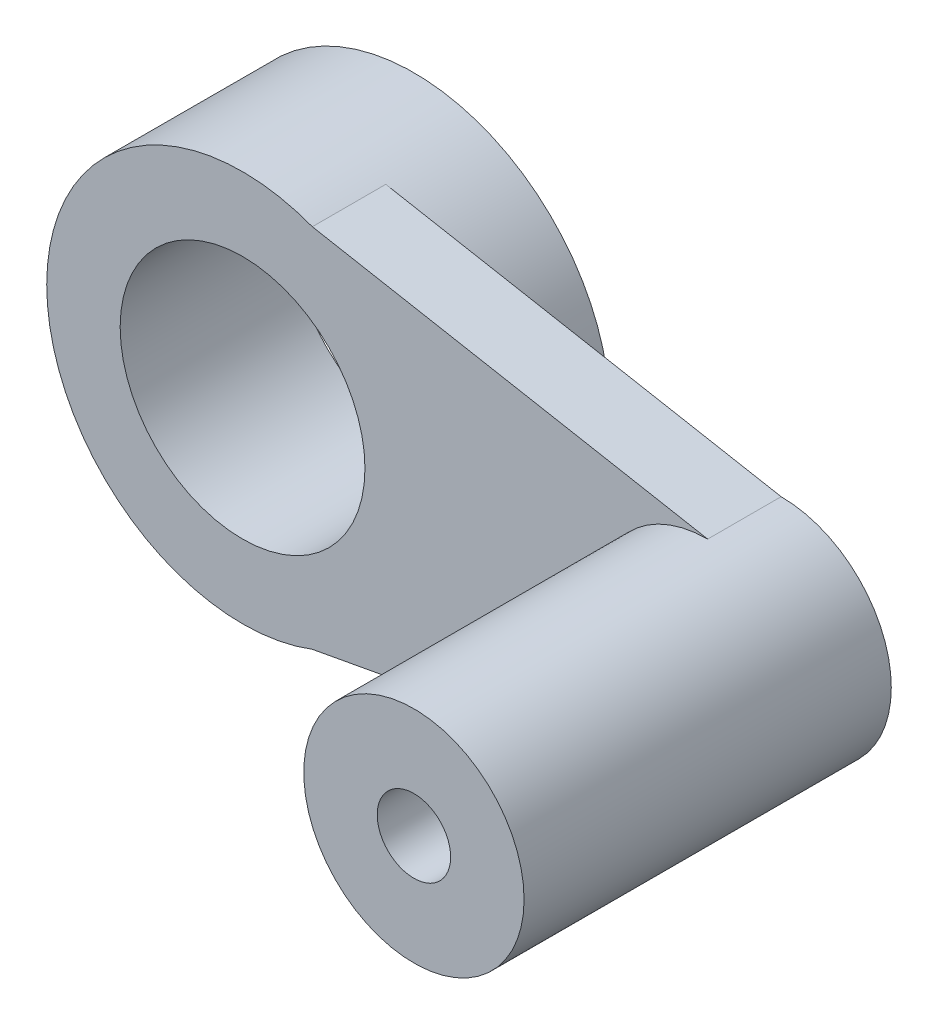
ISO-10303-21;
HEADER;
FILE_DESCRIPTION(('STEP AP214'),'2;1');
FILE_NAME('part.step','',(''),(''),'','','');
FILE_SCHEMA(('AUTOMOTIVE_DESIGN { 1 0 10303 214 1 1 1 1 }'));
ENDSEC;
DATA;
#1=APPLICATION_CONTEXT('core data for automotive mechanical design processes');
#2=APPLICATION_PROTOCOL_DEFINITION('international standard','automotive_design',2000,#1);
#3=PRODUCT_CONTEXT('',#1,'mechanical');
#4=PRODUCT('Part','Part','',(#3));
#5=PRODUCT_RELATED_PRODUCT_CATEGORY('part','',(#4));
#6=PRODUCT_DEFINITION_FORMATION('','',#4);
#7=PRODUCT_DEFINITION_CONTEXT('part definition',#1,'design');
#8=PRODUCT_DEFINITION('design','',#6,#7);
#9=PRODUCT_DEFINITION_SHAPE('','',#8);
#10=(LENGTH_UNIT() NAMED_UNIT(*) SI_UNIT(.MILLI.,.METRE.));
#11=(NAMED_UNIT(*) PLANE_ANGLE_UNIT() SI_UNIT($,.RADIAN.));
#12=(NAMED_UNIT(*) SI_UNIT($,.STERADIAN.) SOLID_ANGLE_UNIT());
#13=UNCERTAINTY_MEASURE_WITH_UNIT(LENGTH_MEASURE(1.E-05),#10,'distance_accuracy_value','');
#14=(GEOMETRIC_REPRESENTATION_CONTEXT(3) GLOBAL_UNCERTAINTY_ASSIGNED_CONTEXT((#13)) GLOBAL_UNIT_ASSIGNED_CONTEXT((#10,
#11,#12)) REPRESENTATION_CONTEXT('',''));
#15=CARTESIAN_POINT('',(0.,0.,0.));
#16=DIRECTION('',(0.,0.,1.));
#17=DIRECTION('',(1.,0.,0.));
#18=AXIS2_PLACEMENT_3D('',#15,#16,#17);
#19=CARTESIAN_POINT('',(0.,0.,14.));
#20=DIRECTION('',(0.,0.,1.));
#21=DIRECTION('',(1.,0.,0.));
#22=AXIS2_PLACEMENT_3D('',#19,#20,#21);
#23=PLANE('',#22);
#24=CARTESIAN_POINT('',(38.,0.,14.));
#25=DIRECTION('',(0.,0.,1.));
#26=DIRECTION('',(1.,0.,0.));
#27=AXIS2_PLACEMENT_3D('',#24,#25,#26);
#28=CIRCLE('',#27,9.);
#29=CARTESIAN_POINT('',(38.,9.,14.));
#30=VERTEX_POINT('',#29);
#31=CARTESIAN_POINT('',(38.,-9.,14.));
#32=VERTEX_POINT('',#31);
#33=EDGE_CURVE('E86',#30,#32,#28,.T.);
#34=ORIENTED_EDGE('',*,*,#33,.F.);
#35=DIRECTION('',(0.983453188589073,-0.181162429476934,0.));
#36=VECTOR('',#35,1.);
#37=CARTESIAN_POINT('',(2.85063630274615,15.4748827863362,14.));
#38=LINE('',#37,#36);
#39=CARTESIAN_POINT('',(5.70127260549231,14.9497655726725,14.));
#40=VERTEX_POINT('',#39);
#41=EDGE_CURVE('E57',#40,#30,#38,.T.);
#42=ORIENTED_EDGE('',*,*,#41,.F.);
#43=CARTESIAN_POINT('',(0.,0.,14.));
#44=DIRECTION('',(0.,0.,1.));
#45=DIRECTION('',(1.,0.,0.));
#46=AXIS2_PLACEMENT_3D('',#43,#44,#45);
#47=CIRCLE('',#46,16.);
#48=CARTESIAN_POINT('',(5.70127260549231,-14.9497655726725,14.));
#49=VERTEX_POINT('',#48);
#50=EDGE_CURVE('E11',#40,#49,#47,.T.);
#51=ORIENTED_EDGE('',*,*,#50,.T.);
#52=DIRECTION('',(0.983453188589073,0.181162429476934,0.));
#53=VECTOR('',#52,1.);
#54=CARTESIAN_POINT('',(2.85063630274615,-15.4748827863362,14.));
#55=LINE('',#54,#53);
#56=EDGE_CURVE('E78',#49,#32,#55,.T.);
#57=ORIENTED_EDGE('',*,*,#56,.T.);
#58=EDGE_LOOP('',(#34,#42,#51,#57));
#59=FACE_BOUND('',#58,.T.);
#60=CARTESIAN_POINT('',(0.,0.,14.));
#61=DIRECTION('',(0.,0.,1.));
#62=DIRECTION('',(1.,0.,0.));
#63=AXIS2_PLACEMENT_3D('',#60,#61,#62);
#64=CIRCLE('',#63,10.);
#65=CARTESIAN_POINT('',(10.,0.,14.));
#66=VERTEX_POINT('',#65);
#67=EDGE_CURVE('E120',#66,#66,#64,.T.);
#68=ORIENTED_EDGE('',*,*,#67,.F.);
#69=EDGE_LOOP('',(#68));
#70=FACE_BOUND('',#69,.T.);
#71=ADVANCED_FACE('F43',(#59,#70),#23,.T.);
#72=CARTESIAN_POINT('',(0.,0.,0.));
#73=DIRECTION('',(0.,0.,1.));
#74=DIRECTION('',(1.,0.,0.));
#75=AXIS2_PLACEMENT_3D('',#72,#73,#74);
#76=PLANE('',#75);
#77=CARTESIAN_POINT('',(0.,0.,0.));
#78=DIRECTION('',(0.,0.,1.));
#79=DIRECTION('',(1.,0.,0.));
#80=AXIS2_PLACEMENT_3D('',#77,#78,#79);
#81=CIRCLE('',#80,16.);
#82=CARTESIAN_POINT('',(16.,0.,0.));
#83=VERTEX_POINT('',#82);
#84=EDGE_CURVE('E47',#83,#83,#81,.T.);
#85=ORIENTED_EDGE('',*,*,#84,.F.);
#86=EDGE_LOOP('',(#85));
#87=FACE_BOUND('',#86,.T.);
#88=CARTESIAN_POINT('',(0.,0.,0.));
#89=DIRECTION('',(0.,0.,1.));
#90=DIRECTION('',(1.,0.,0.));
#91=AXIS2_PLACEMENT_3D('',#88,#89,#90);
#92=CIRCLE('',#91,10.);
#93=CARTESIAN_POINT('',(10.,0.,0.));
#94=VERTEX_POINT('',#93);
#95=EDGE_CURVE('E116',#94,#94,#92,.T.);
#96=ORIENTED_EDGE('',*,*,#95,.T.);
#97=EDGE_LOOP('',(#96));
#98=FACE_BOUND('',#97,.T.);
#99=ADVANCED_FACE('F126',(#87,#98),#76,.F.);
#100=CARTESIAN_POINT('',(0.,0.,14.));
#101=DIRECTION('',(0.,0.,-1.));
#102=DIRECTION('',(-1.,0.,0.));
#103=AXIS2_PLACEMENT_3D('',#100,#101,#102);
#104=CYLINDRICAL_SURFACE('',#103,16.);
#105=CARTESIAN_POINT('',(0.,0.,8.));
#106=DIRECTION('',(0.,0.,1.));
#107=DIRECTION('',(1.,0.,0.));
#108=AXIS2_PLACEMENT_3D('',#105,#106,#107);
#109=CIRCLE('',#108,16.);
#110=CARTESIAN_POINT('',(5.70127260549231,-14.9497655726725,8.));
#111=VERTEX_POINT('',#110);
#112=CARTESIAN_POINT('',(5.70127260549231,14.9497655726725,8.));
#113=VERTEX_POINT('',#112);
#114=EDGE_CURVE('E265',#111,#113,#109,.T.);
#115=ORIENTED_EDGE('',*,*,#114,.F.);
#116=DIRECTION('',(0.,0.,1.));
#117=VECTOR('',#116,1.);
#118=CARTESIAN_POINT('',(5.70127260549231,-14.9497655726725,8.));
#119=LINE('',#118,#117);
#120=EDGE_CURVE('E117',#111,#49,#119,.T.);
#121=ORIENTED_EDGE('',*,*,#120,.T.);
#122=ORIENTED_EDGE('',*,*,#50,.F.);
#123=DIRECTION('',(0.,0.,1.));
#124=VECTOR('',#123,1.);
#125=CARTESIAN_POINT('',(5.70127260549231,14.9497655726725,8.));
#126=LINE('',#125,#124);
#127=EDGE_CURVE('E100',#113,#40,#126,.T.);
#128=ORIENTED_EDGE('',*,*,#127,.F.);
#129=EDGE_LOOP('',(#115,#121,#122,#128));
#130=FACE_BOUND('',#129,.T.);
#131=ORIENTED_EDGE('',*,*,#84,.T.);
#132=EDGE_LOOP('',(#131));
#133=FACE_BOUND('',#132,.T.);
#134=ADVANCED_FACE('F45',(#130,#133),#104,.T.);
#135=CARTESIAN_POINT('',(0.,0.,14.));
#136=DIRECTION('',(0.,0.,-1.));
#137=DIRECTION('',(-1.,0.,0.));
#138=AXIS2_PLACEMENT_3D('',#135,#136,#137);
#139=CYLINDRICAL_SURFACE('',#138,10.);
#140=ORIENTED_EDGE('',*,*,#67,.T.);
#141=EDGE_LOOP('',(#140));
#142=FACE_BOUND('',#141,.T.);
#143=ORIENTED_EDGE('',*,*,#95,.F.);
#144=EDGE_LOOP('',(#143));
#145=FACE_BOUND('',#144,.T.);
#146=ADVANCED_FACE('F128',(#142,#145),#139,.F.);
#147=CARTESIAN_POINT('',(2.85063630274615,-15.4748827863362,8.));
#148=DIRECTION('',(0.181162429476934,-0.983453188589073,0.));
#149=DIRECTION('',(0.983453188589073,0.181162429476934,0.));
#150=AXIS2_PLACEMENT_3D('',#147,#148,#149);
#151=PLANE('',#150);
#152=ORIENTED_EDGE('',*,*,#56,.F.);
#153=ORIENTED_EDGE('',*,*,#120,.F.);
#154=DIRECTION('',(0.983453188589073,0.181162429476934,0.));
#155=VECTOR('',#154,1.);
#156=CARTESIAN_POINT('',(2.85063630274615,-15.4748827863362,8.));
#157=LINE('',#156,#155);
#158=CARTESIAN_POINT('',(38.,-9.,8.));
#159=VERTEX_POINT('',#158);
#160=EDGE_CURVE('E101',#111,#159,#157,.T.);
#161=ORIENTED_EDGE('',*,*,#160,.T.);
#162=DIRECTION('',(0.,0.,1.));
#163=VECTOR('',#162,1.);
#164=CARTESIAN_POINT('',(38.,-9.,8.));
#165=LINE('',#164,#163);
#166=EDGE_CURVE('E114',#159,#32,#165,.T.);
#167=ORIENTED_EDGE('',*,*,#166,.T.);
#168=EDGE_LOOP('',(#152,#153,#161,#167));
#169=FACE_BOUND('',#168,.T.);
#170=ADVANCED_FACE('F130',(#169),#151,.T.);
#171=CARTESIAN_POINT('',(2.85063630274615,15.4748827863362,8.));
#172=DIRECTION('',(-0.181162429476934,-0.983453188589073,0.));
#173=DIRECTION('',(0.983453188589073,-0.181162429476934,0.));
#174=AXIS2_PLACEMENT_3D('',#171,#172,#173);
#175=PLANE('',#174);
#176=ORIENTED_EDGE('',*,*,#41,.T.);
#177=DIRECTION('',(0.,0.,1.));
#178=VECTOR('',#177,1.);
#179=CARTESIAN_POINT('',(38.,9.,8.));
#180=LINE('',#179,#178);
#181=CARTESIAN_POINT('',(38.,9.,8.));
#182=VERTEX_POINT('',#181);
#183=EDGE_CURVE('E95',#182,#30,#180,.T.);
#184=ORIENTED_EDGE('',*,*,#183,.F.);
#185=DIRECTION('',(0.983453188589073,-0.181162429476934,0.));
#186=VECTOR('',#185,1.);
#187=CARTESIAN_POINT('',(2.85063630274615,15.4748827863362,8.));
#188=LINE('',#187,#186);
#189=EDGE_CURVE('E107',#113,#182,#188,.T.);
#190=ORIENTED_EDGE('',*,*,#189,.F.);
#191=ORIENTED_EDGE('',*,*,#127,.T.);
#192=EDGE_LOOP('',(#176,#184,#190,#191));
#193=FACE_BOUND('',#192,.T.);
#194=ADVANCED_FACE('F103',(#193),#175,.F.);
#195=CARTESIAN_POINT('',(0.,0.,8.));
#196=DIRECTION('',(0.,0.,1.));
#197=DIRECTION('',(1.,0.,0.));
#198=AXIS2_PLACEMENT_3D('',#195,#196,#197);
#199=PLANE('',#198);
#200=ORIENTED_EDGE('',*,*,#189,.T.);
#201=CARTESIAN_POINT('',(38.,0.,8.));
#202=DIRECTION('',(0.,0.,-1.));
#203=DIRECTION('',(-1.,0.,0.));
#204=AXIS2_PLACEMENT_3D('',#201,#202,#203);
#205=CIRCLE('',#204,9.);
#206=EDGE_CURVE('E66',#182,#159,#205,.T.);
#207=ORIENTED_EDGE('',*,*,#206,.T.);
#208=ORIENTED_EDGE('',*,*,#160,.F.);
#209=ORIENTED_EDGE('',*,*,#114,.T.);
#210=EDGE_LOOP('',(#200,#207,#208,#209));
#211=FACE_BOUND('',#210,.T.);
#212=CARTESIAN_POINT('',(38.,0.,8.));
#213=DIRECTION('',(0.,0.,-1.));
#214=DIRECTION('',(-1.,0.,0.));
#215=AXIS2_PLACEMENT_3D('',#212,#213,#214);
#216=CIRCLE('',#215,3.);
#217=CARTESIAN_POINT('',(35.,0.,8.));
#218=VERTEX_POINT('',#217);
#219=EDGE_CURVE('E109',#218,#218,#216,.T.);
#220=ORIENTED_EDGE('',*,*,#219,.F.);
#221=EDGE_LOOP('',(#220));
#222=FACE_BOUND('',#221,.T.);
#223=ADVANCED_FACE('F181',(#211,#222),#199,.F.);
#224=CARTESIAN_POINT('',(38.,0.,8.));
#225=DIRECTION('',(0.,0.,1.));
#226=DIRECTION('',(1.,0.,0.));
#227=AXIS2_PLACEMENT_3D('',#224,#225,#226);
#228=CYLINDRICAL_SURFACE('',#227,9.);
#229=ORIENTED_EDGE('',*,*,#166,.F.);
#230=ORIENTED_EDGE('',*,*,#206,.F.);
#231=ORIENTED_EDGE('',*,*,#183,.T.);
#232=ORIENTED_EDGE('',*,*,#33,.T.);
#233=EDGE_LOOP('',(#229,#230,#231,#232));
#234=FACE_BOUND('',#233,.T.);
#235=CARTESIAN_POINT('',(38.,0.,38.));
#236=DIRECTION('',(0.,0.,1.));
#237=DIRECTION('',(1.,0.,0.));
#238=AXIS2_PLACEMENT_3D('',#235,#236,#237);
#239=CIRCLE('',#238,9.);
#240=CARTESIAN_POINT('',(47.,0.,38.));
#241=VERTEX_POINT('',#240);
#242=EDGE_CURVE('E91',#241,#241,#239,.T.);
#243=ORIENTED_EDGE('',*,*,#242,.F.);
#244=EDGE_LOOP('',(#243));
#245=FACE_BOUND('',#244,.T.);
#246=ADVANCED_FACE('F96',(#234,#245),#228,.T.);
#247=CARTESIAN_POINT('',(38.,0.,8.));
#248=DIRECTION('',(0.,0.,1.));
#249=DIRECTION('',(1.,0.,0.));
#250=AXIS2_PLACEMENT_3D('',#247,#248,#249);
#251=CYLINDRICAL_SURFACE('',#250,3.);
#252=ORIENTED_EDGE('',*,*,#219,.T.);
#253=EDGE_LOOP('',(#252));
#254=FACE_BOUND('',#253,.T.);
#255=CARTESIAN_POINT('',(38.,0.,38.));
#256=DIRECTION('',(0.,0.,1.));
#257=DIRECTION('',(1.,0.,0.));
#258=AXIS2_PLACEMENT_3D('',#255,#256,#257);
#259=CIRCLE('',#258,3.);
#260=CARTESIAN_POINT('',(41.,0.,38.));
#261=VERTEX_POINT('',#260);
#262=EDGE_CURVE('E92',#261,#261,#259,.T.);
#263=ORIENTED_EDGE('',*,*,#262,.T.);
#264=EDGE_LOOP('',(#263));
#265=FACE_BOUND('',#264,.T.);
#266=ADVANCED_FACE('F198',(#254,#265),#251,.F.);
#267=CARTESIAN_POINT('',(38.,0.,38.));
#268=DIRECTION('',(0.,0.,1.));
#269=DIRECTION('',(1.,0.,0.));
#270=AXIS2_PLACEMENT_3D('',#267,#268,#269);
#271=PLANE('',#270);
#272=ORIENTED_EDGE('',*,*,#242,.T.);
#273=EDGE_LOOP('',(#272));
#274=FACE_BOUND('',#273,.T.);
#275=ORIENTED_EDGE('',*,*,#262,.F.);
#276=EDGE_LOOP('',(#275));
#277=FACE_BOUND('',#276,.T.);
#278=ADVANCED_FACE('F208',(#274,#277),#271,.T.);
#279=CLOSED_SHELL('',(#71,#99,#134,#146,#170,#194,#223,#246,#266,#278));
#280=MANIFOLD_SOLID_BREP('B2',#279);
#281=ADVANCED_BREP_SHAPE_REPRESENTATION('',(#18,#280),#14);
#282=SHAPE_DEFINITION_REPRESENTATION(#9,#281);
ENDSEC;
END-ISO-10303-21;
